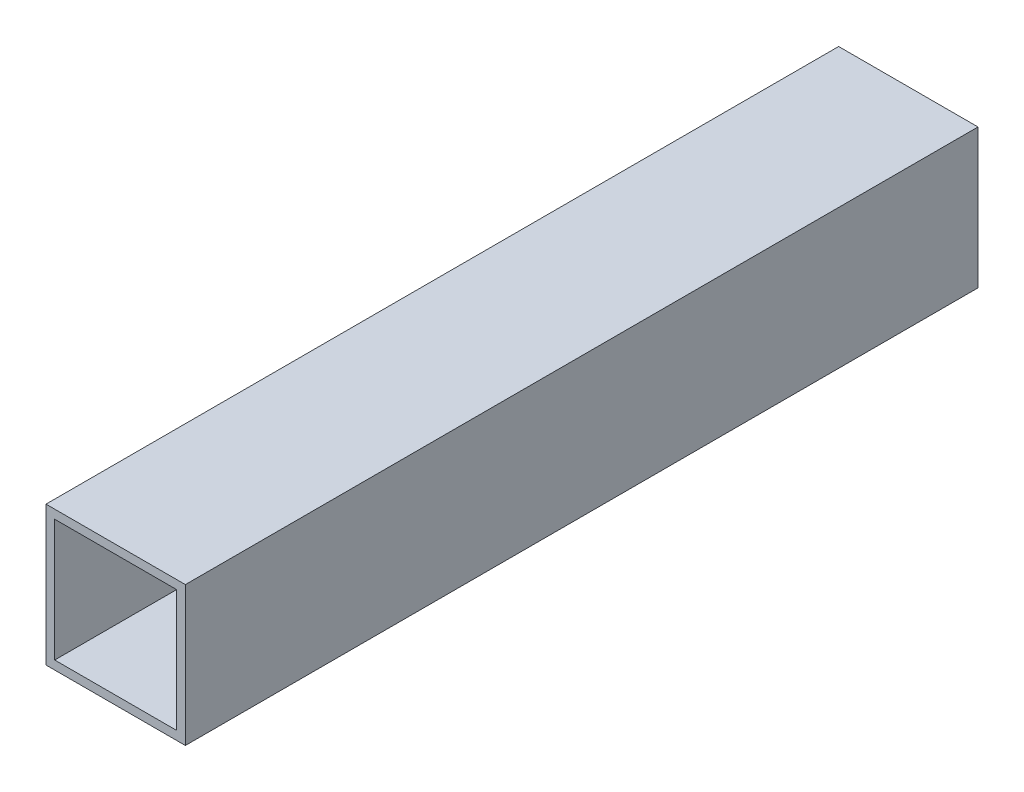
ISO-10303-21;
HEADER;
FILE_DESCRIPTION(('STEP AP214'),'2;1');
FILE_NAME('part.step','',(''),(''),'','','');
FILE_SCHEMA(('AUTOMOTIVE_DESIGN { 1 0 10303 214 1 1 1 1 }'));
ENDSEC;
DATA;
#1=APPLICATION_CONTEXT('core data for automotive mechanical design processes');
#2=APPLICATION_PROTOCOL_DEFINITION('international standard','automotive_design',2000,#1);
#3=PRODUCT_CONTEXT('',#1,'mechanical');
#4=PRODUCT('Part','Part','',(#3));
#5=PRODUCT_RELATED_PRODUCT_CATEGORY('part','',(#4));
#6=PRODUCT_DEFINITION_FORMATION('','',#4);
#7=PRODUCT_DEFINITION_CONTEXT('part definition',#1,'design');
#8=PRODUCT_DEFINITION('design','',#6,#7);
#9=PRODUCT_DEFINITION_SHAPE('','',#8);
#10=(LENGTH_UNIT() NAMED_UNIT(*) SI_UNIT(.MILLI.,.METRE.));
#11=(NAMED_UNIT(*) PLANE_ANGLE_UNIT() SI_UNIT($,.RADIAN.));
#12=(NAMED_UNIT(*) SI_UNIT($,.STERADIAN.) SOLID_ANGLE_UNIT());
#13=UNCERTAINTY_MEASURE_WITH_UNIT(LENGTH_MEASURE(1.E-05),#10,'distance_accuracy_value','');
#14=(GEOMETRIC_REPRESENTATION_CONTEXT(3) GLOBAL_UNCERTAINTY_ASSIGNED_CONTEXT((#13)) GLOBAL_UNIT_ASSIGNED_CONTEXT((#10,
#11,#12)) REPRESENTATION_CONTEXT('',''));
#15=CARTESIAN_POINT('',(0.,0.,0.));
#16=DIRECTION('',(0.,0.,1.));
#17=DIRECTION('',(1.,0.,0.));
#18=AXIS2_PLACEMENT_3D('',#15,#16,#17);
#19=CARTESIAN_POINT('',(0.,0.,76.2));
#20=DIRECTION('',(0.,0.,1.));
#21=DIRECTION('',(1.,0.,0.));
#22=AXIS2_PLACEMENT_3D('',#19,#20,#21);
#23=PLANE('',#22);
#24=DIRECTION('',(0.,-1.,0.));
#25=VECTOR('',#24,1.);
#26=CARTESIAN_POINT('',(-12.7,12.7,76.2));
#27=LINE('',#26,#25);
#28=CARTESIAN_POINT('',(-12.7,12.7,76.2));
#29=VERTEX_POINT('',#28);
#30=CARTESIAN_POINT('',(-12.7,-12.7,76.2));
#31=VERTEX_POINT('',#30);
#32=EDGE_CURVE('E137',#29,#31,#27,.T.);
#33=ORIENTED_EDGE('',*,*,#32,.T.);
#34=DIRECTION('',(1.,0.,0.));
#35=VECTOR('',#34,1.);
#36=CARTESIAN_POINT('',(-12.7,-12.7,76.2));
#37=LINE('',#36,#35);
#38=CARTESIAN_POINT('',(12.7,-12.7,76.2));
#39=VERTEX_POINT('',#38);
#40=EDGE_CURVE('E146',#31,#39,#37,.T.);
#41=ORIENTED_EDGE('',*,*,#40,.T.);
#42=DIRECTION('',(0.,1.,0.));
#43=VECTOR('',#42,1.);
#44=CARTESIAN_POINT('',(12.7,-12.7,76.2));
#45=LINE('',#44,#43);
#46=CARTESIAN_POINT('',(12.7,12.7,76.2));
#47=VERTEX_POINT('',#46);
#48=EDGE_CURVE('E149',#39,#47,#45,.T.);
#49=ORIENTED_EDGE('',*,*,#48,.T.);
#50=DIRECTION('',(-1.,0.,0.));
#51=VECTOR('',#50,1.);
#52=CARTESIAN_POINT('',(12.7,12.7,76.2));
#53=LINE('',#52,#51);
#54=EDGE_CURVE('E152',#47,#29,#53,.T.);
#55=ORIENTED_EDGE('',*,*,#54,.T.);
#56=EDGE_LOOP('',(#33,#41,#49,#55));
#57=FACE_BOUND('',#56,.T.);
#58=DIRECTION('',(1.,0.,0.));
#59=VECTOR('',#58,1.);
#60=CARTESIAN_POINT('',(-11.1125,-11.1125,76.2));
#61=LINE('',#60,#59);
#62=CARTESIAN_POINT('',(-11.1125,-11.1125,76.2));
#63=VERTEX_POINT('',#62);
#64=CARTESIAN_POINT('',(11.1125,-11.1125,76.2));
#65=VERTEX_POINT('',#64);
#66=EDGE_CURVE('E131',#63,#65,#61,.T.);
#67=ORIENTED_EDGE('',*,*,#66,.F.);
#68=DIRECTION('',(0.,-1.,0.));
#69=VECTOR('',#68,1.);
#70=CARTESIAN_POINT('',(-11.1125,11.1125,76.2));
#71=LINE('',#70,#69);
#72=CARTESIAN_POINT('',(-11.1125,11.1125,76.2));
#73=VERTEX_POINT('',#72);
#74=EDGE_CURVE('E186',#73,#63,#71,.T.);
#75=ORIENTED_EDGE('',*,*,#74,.F.);
#76=DIRECTION('',(-1.,0.,0.));
#77=VECTOR('',#76,1.);
#78=CARTESIAN_POINT('',(11.1125,11.1125,76.2));
#79=LINE('',#78,#77);
#80=CARTESIAN_POINT('',(11.1125,11.1125,76.2));
#81=VERTEX_POINT('',#80);
#82=EDGE_CURVE('E194',#81,#73,#79,.T.);
#83=ORIENTED_EDGE('',*,*,#82,.F.);
#84=DIRECTION('',(0.,1.,0.));
#85=VECTOR('',#84,1.);
#86=CARTESIAN_POINT('',(11.1125,-11.1125,76.2));
#87=LINE('',#86,#85);
#88=EDGE_CURVE('E191',#65,#81,#87,.T.);
#89=ORIENTED_EDGE('',*,*,#88,.F.);
#90=EDGE_LOOP('',(#67,#75,#83,#89));
#91=FACE_BOUND('',#90,.T.);
#92=ADVANCED_FACE('F44',(#57,#91),#23,.T.);
#93=CARTESIAN_POINT('',(-12.7,12.7,76.2));
#94=DIRECTION('',(1.,0.,0.));
#95=DIRECTION('',(0.,0.,-1.));
#96=AXIS2_PLACEMENT_3D('',#93,#94,#95);
#97=PLANE('',#96);
#98=DIRECTION('',(0.,0.,-1.));
#99=VECTOR('',#98,1.);
#100=CARTESIAN_POINT('',(-12.7,12.7,76.2));
#101=LINE('',#100,#99);
#102=CARTESIAN_POINT('',(-12.7,12.7,-68.2624999999999));
#103=VERTEX_POINT('',#102);
#104=EDGE_CURVE('E155',#29,#103,#101,.T.);
#105=ORIENTED_EDGE('',*,*,#104,.T.);
#106=DIRECTION('',(0.,1.,0.));
#107=VECTOR('',#106,1.);
#108=CARTESIAN_POINT('',(-12.7,-12.7,-68.2624999999999));
#109=LINE('',#108,#107);
#110=CARTESIAN_POINT('',(-12.7,-12.7,-68.2624999999999));
#111=VERTEX_POINT('',#110);
#112=EDGE_CURVE('E60',#111,#103,#109,.T.);
#113=ORIENTED_EDGE('',*,*,#112,.F.);
#114=DIRECTION('',(0.,0.,-1.));
#115=VECTOR('',#114,1.);
#116=CARTESIAN_POINT('',(-12.7,-12.7,76.2));
#117=LINE('',#116,#115);
#118=EDGE_CURVE('E12',#31,#111,#117,.T.);
#119=ORIENTED_EDGE('',*,*,#118,.F.);
#120=ORIENTED_EDGE('',*,*,#32,.F.);
#121=EDGE_LOOP('',(#105,#113,#119,#120));
#122=FACE_BOUND('',#121,.T.);
#123=ADVANCED_FACE('F46',(#122),#97,.F.);
#124=CARTESIAN_POINT('',(-12.7,-12.7,76.2));
#125=DIRECTION('',(0.,1.,0.));
#126=DIRECTION('',(-1.,0.,0.));
#127=AXIS2_PLACEMENT_3D('',#124,#125,#126);
#128=PLANE('',#127);
#129=ORIENTED_EDGE('',*,*,#118,.T.);
#130=DIRECTION('',(-1.,0.,0.));
#131=VECTOR('',#130,1.);
#132=CARTESIAN_POINT('',(12.7,-12.7,-68.2624999999999));
#133=LINE('',#132,#131);
#134=CARTESIAN_POINT('',(12.7,-12.7,-68.2624999999999));
#135=VERTEX_POINT('',#134);
#136=EDGE_CURVE('E174',#135,#111,#133,.T.);
#137=ORIENTED_EDGE('',*,*,#136,.F.);
#138=DIRECTION('',(0.,0.,-1.));
#139=VECTOR('',#138,1.);
#140=CARTESIAN_POINT('',(12.7,-12.7,76.2));
#141=LINE('',#140,#139);
#142=EDGE_CURVE('E53',#39,#135,#141,.T.);
#143=ORIENTED_EDGE('',*,*,#142,.F.);
#144=ORIENTED_EDGE('',*,*,#40,.F.);
#145=EDGE_LOOP('',(#129,#137,#143,#144));
#146=FACE_BOUND('',#145,.T.);
#147=ADVANCED_FACE('F173',(#146),#128,.F.);
#148=CARTESIAN_POINT('',(12.7,-12.7,76.2));
#149=DIRECTION('',(-1.,0.,0.));
#150=DIRECTION('',(0.,0.,1.));
#151=AXIS2_PLACEMENT_3D('',#148,#149,#150);
#152=PLANE('',#151);
#153=ORIENTED_EDGE('',*,*,#142,.T.);
#154=DIRECTION('',(0.,-1.,0.));
#155=VECTOR('',#154,1.);
#156=CARTESIAN_POINT('',(12.7,12.7,-68.2624999999999));
#157=LINE('',#156,#155);
#158=CARTESIAN_POINT('',(12.7,12.7,-68.2624999999999));
#159=VERTEX_POINT('',#158);
#160=EDGE_CURVE('E170',#159,#135,#157,.T.);
#161=ORIENTED_EDGE('',*,*,#160,.F.);
#162=DIRECTION('',(0.,0.,-1.));
#163=VECTOR('',#162,1.);
#164=CARTESIAN_POINT('',(12.7,12.7,76.2));
#165=LINE('',#164,#163);
#166=EDGE_CURVE('E159',#47,#159,#165,.T.);
#167=ORIENTED_EDGE('',*,*,#166,.F.);
#168=ORIENTED_EDGE('',*,*,#48,.F.);
#169=EDGE_LOOP('',(#153,#161,#167,#168));
#170=FACE_BOUND('',#169,.T.);
#171=ADVANCED_FACE('F168',(#170),#152,.F.);
#172=CARTESIAN_POINT('',(12.7,12.7,76.2));
#173=DIRECTION('',(0.,-1.,0.));
#174=DIRECTION('',(1.,0.,0.));
#175=AXIS2_PLACEMENT_3D('',#172,#173,#174);
#176=PLANE('',#175);
#177=ORIENTED_EDGE('',*,*,#166,.T.);
#178=DIRECTION('',(1.,0.,0.));
#179=VECTOR('',#178,1.);
#180=CARTESIAN_POINT('',(-12.7,12.7,-68.2624999999999));
#181=LINE('',#180,#179);
#182=EDGE_CURVE('E179',#103,#159,#181,.T.);
#183=ORIENTED_EDGE('',*,*,#182,.F.);
#184=ORIENTED_EDGE('',*,*,#104,.F.);
#185=ORIENTED_EDGE('',*,*,#54,.F.);
#186=EDGE_LOOP('',(#177,#183,#184,#185));
#187=FACE_BOUND('',#186,.T.);
#188=ADVANCED_FACE('F217',(#187),#176,.F.);
#189=CARTESIAN_POINT('',(-11.1125,11.1125,76.2));
#190=DIRECTION('',(1.,0.,0.));
#191=DIRECTION('',(0.,1.,0.));
#192=AXIS2_PLACEMENT_3D('',#189,#190,#191);
#193=PLANE('',#192);
#194=DIRECTION('',(0.,1.,0.));
#195=VECTOR('',#194,1.);
#196=CARTESIAN_POINT('',(-11.1125,-11.1125,-68.2624999999999));
#197=LINE('',#196,#195);
#198=CARTESIAN_POINT('',(-11.1125,-11.1125,-68.2624999999999));
#199=VERTEX_POINT('',#198);
#200=CARTESIAN_POINT('',(-11.1125,11.1125,-68.2624999999999));
#201=VERTEX_POINT('',#200);
#202=EDGE_CURVE('E111',#199,#201,#197,.T.);
#203=ORIENTED_EDGE('',*,*,#202,.T.);
#204=DIRECTION('',(0.,0.,-1.));
#205=VECTOR('',#204,1.);
#206=CARTESIAN_POINT('',(-11.1125,11.1125,76.2));
#207=LINE('',#206,#205);
#208=EDGE_CURVE('E139',#73,#201,#207,.T.);
#209=ORIENTED_EDGE('',*,*,#208,.F.);
#210=ORIENTED_EDGE('',*,*,#74,.T.);
#211=DIRECTION('',(0.,0.,-1.));
#212=VECTOR('',#211,1.);
#213=CARTESIAN_POINT('',(-11.1125,-11.1125,76.2));
#214=LINE('',#213,#212);
#215=EDGE_CURVE('E133',#63,#199,#214,.T.);
#216=ORIENTED_EDGE('',*,*,#215,.T.);
#217=EDGE_LOOP('',(#203,#209,#210,#216));
#218=FACE_BOUND('',#217,.T.);
#219=ADVANCED_FACE('F204',(#218),#193,.T.);
#220=CARTESIAN_POINT('',(-11.1125,-11.1125,76.2));
#221=DIRECTION('',(0.,1.,0.));
#222=DIRECTION('',(0.,0.,1.));
#223=AXIS2_PLACEMENT_3D('',#220,#221,#222);
#224=PLANE('',#223);
#225=DIRECTION('',(-1.,0.,0.));
#226=VECTOR('',#225,1.);
#227=CARTESIAN_POINT('',(11.1125,-11.1125,-68.2624999999999));
#228=LINE('',#227,#226);
#229=CARTESIAN_POINT('',(11.1125,-11.1125,-68.2624999999999));
#230=VERTEX_POINT('',#229);
#231=EDGE_CURVE('E108',#230,#199,#228,.T.);
#232=ORIENTED_EDGE('',*,*,#231,.T.);
#233=ORIENTED_EDGE('',*,*,#215,.F.);
#234=ORIENTED_EDGE('',*,*,#66,.T.);
#235=DIRECTION('',(0.,0.,-1.));
#236=VECTOR('',#235,1.);
#237=CARTESIAN_POINT('',(11.1125,-11.1125,76.2));
#238=LINE('',#237,#236);
#239=EDGE_CURVE('E123',#65,#230,#238,.T.);
#240=ORIENTED_EDGE('',*,*,#239,.T.);
#241=EDGE_LOOP('',(#232,#233,#234,#240));
#242=FACE_BOUND('',#241,.T.);
#243=ADVANCED_FACE('F129',(#242),#224,.T.);
#244=CARTESIAN_POINT('',(11.1125,-11.1125,76.2));
#245=DIRECTION('',(-1.,0.,0.));
#246=DIRECTION('',(0.,-1.,0.));
#247=AXIS2_PLACEMENT_3D('',#244,#245,#246);
#248=PLANE('',#247);
#249=DIRECTION('',(0.,-1.,0.));
#250=VECTOR('',#249,1.);
#251=CARTESIAN_POINT('',(11.1125,11.1125,-68.2624999999999));
#252=LINE('',#251,#250);
#253=CARTESIAN_POINT('',(11.1125,11.1125,-68.2624999999999));
#254=VERTEX_POINT('',#253);
#255=EDGE_CURVE('E68',#254,#230,#252,.T.);
#256=ORIENTED_EDGE('',*,*,#255,.T.);
#257=ORIENTED_EDGE('',*,*,#239,.F.);
#258=ORIENTED_EDGE('',*,*,#88,.T.);
#259=DIRECTION('',(0.,0.,-1.));
#260=VECTOR('',#259,1.);
#261=CARTESIAN_POINT('',(11.1125,11.1125,76.2));
#262=LINE('',#261,#260);
#263=EDGE_CURVE('E125',#81,#254,#262,.T.);
#264=ORIENTED_EDGE('',*,*,#263,.T.);
#265=EDGE_LOOP('',(#256,#257,#258,#264));
#266=FACE_BOUND('',#265,.T.);
#267=ADVANCED_FACE('F121',(#266),#248,.T.);
#268=CARTESIAN_POINT('',(11.1125,11.1125,76.2));
#269=DIRECTION('',(0.,-1.,0.));
#270=DIRECTION('',(0.,0.,-1.));
#271=AXIS2_PLACEMENT_3D('',#268,#269,#270);
#272=PLANE('',#271);
#273=DIRECTION('',(1.,0.,0.));
#274=VECTOR('',#273,1.);
#275=CARTESIAN_POINT('',(-11.1125,11.1125,-68.2624999999999));
#276=LINE('',#275,#274);
#277=EDGE_CURVE('E127',#201,#254,#276,.T.);
#278=ORIENTED_EDGE('',*,*,#277,.T.);
#279=ORIENTED_EDGE('',*,*,#263,.F.);
#280=ORIENTED_EDGE('',*,*,#82,.T.);
#281=ORIENTED_EDGE('',*,*,#208,.T.);
#282=EDGE_LOOP('',(#278,#279,#280,#281));
#283=FACE_BOUND('',#282,.T.);
#284=ADVANCED_FACE('F200',(#283),#272,.T.);
#285=CARTESIAN_POINT('',(0.,0.,-68.2624999999999));
#286=DIRECTION('',(0.,0.,1.));
#287=DIRECTION('',(1.,0.,0.));
#288=AXIS2_PLACEMENT_3D('',#285,#286,#287);
#289=PLANE('',#288);
#290=ORIENTED_EDGE('',*,*,#136,.T.);
#291=ORIENTED_EDGE('',*,*,#112,.T.);
#292=ORIENTED_EDGE('',*,*,#182,.T.);
#293=ORIENTED_EDGE('',*,*,#160,.T.);
#294=EDGE_LOOP('',(#290,#291,#292,#293));
#295=FACE_BOUND('',#294,.T.);
#296=ORIENTED_EDGE('',*,*,#277,.F.);
#297=ORIENTED_EDGE('',*,*,#202,.F.);
#298=ORIENTED_EDGE('',*,*,#231,.F.);
#299=ORIENTED_EDGE('',*,*,#255,.F.);
#300=EDGE_LOOP('',(#296,#297,#298,#299));
#301=FACE_BOUND('',#300,.T.);
#302=ADVANCED_FACE('F109',(#295,#301),#289,.F.);
#303=CLOSED_SHELL('',(#92,#123,#147,#171,#188,#219,#243,#267,#284,#302));
#304=MANIFOLD_SOLID_BREP('B2',#303);
#305=ADVANCED_BREP_SHAPE_REPRESENTATION('',(#18,#304),#14);
#306=SHAPE_DEFINITION_REPRESENTATION(#9,#305);
ENDSEC;
END-ISO-10303-21;
